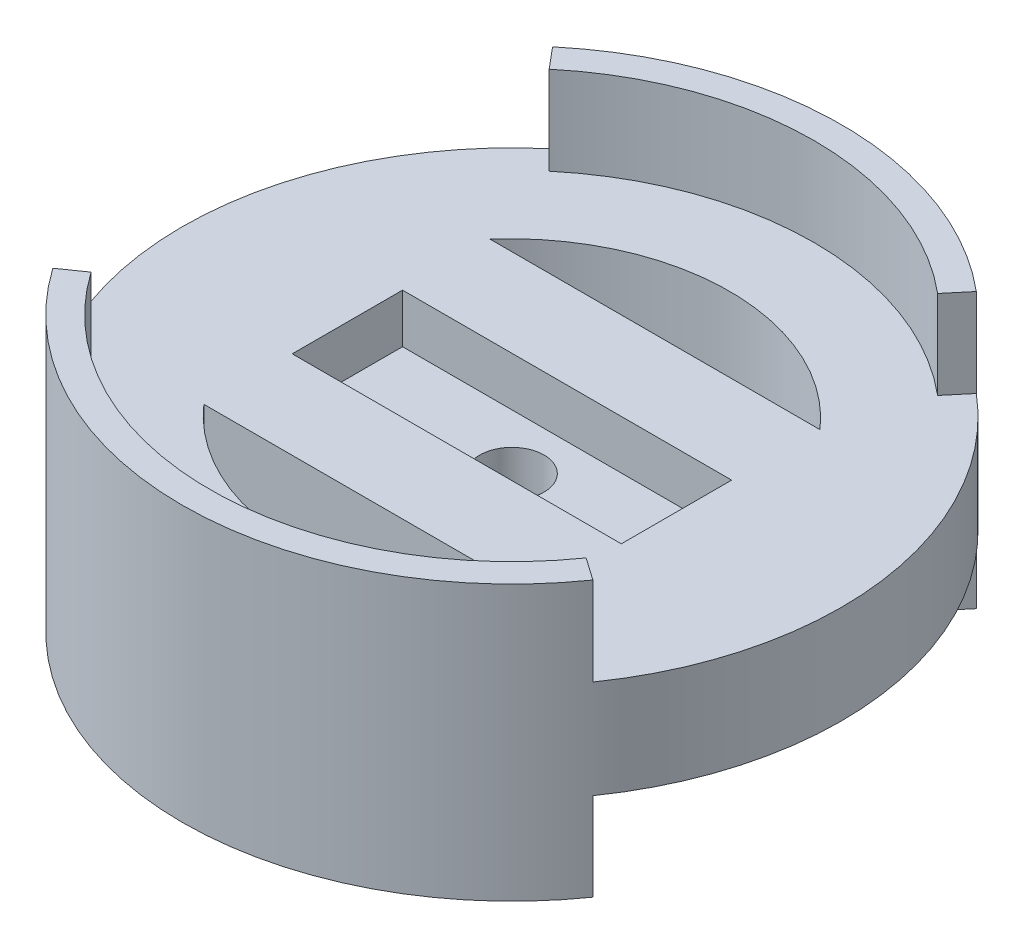
ISO-10303-21;
HEADER;
FILE_DESCRIPTION(('STEP AP214'),'2;1');
FILE_NAME('part.step','',(''),(''),'','','');
FILE_SCHEMA(('AUTOMOTIVE_DESIGN { 1 0 10303 214 1 1 1 1 }'));
ENDSEC;
DATA;
#1=APPLICATION_CONTEXT('core data for automotive mechanical design processes');
#2=APPLICATION_PROTOCOL_DEFINITION('international standard','automotive_design',2000,#1);
#3=PRODUCT_CONTEXT('',#1,'mechanical');
#4=PRODUCT('Part','Part','',(#3));
#5=PRODUCT_RELATED_PRODUCT_CATEGORY('part','',(#4));
#6=PRODUCT_DEFINITION_FORMATION('','',#4);
#7=PRODUCT_DEFINITION_CONTEXT('part definition',#1,'design');
#8=PRODUCT_DEFINITION('design','',#6,#7);
#9=PRODUCT_DEFINITION_SHAPE('','',#8);
#10=(LENGTH_UNIT() NAMED_UNIT(*) SI_UNIT(.MILLI.,.METRE.));
#11=(NAMED_UNIT(*) PLANE_ANGLE_UNIT() SI_UNIT($,.RADIAN.));
#12=(NAMED_UNIT(*) SI_UNIT($,.STERADIAN.) SOLID_ANGLE_UNIT());
#13=UNCERTAINTY_MEASURE_WITH_UNIT(LENGTH_MEASURE(1.E-05),#10,'distance_accuracy_value','');
#14=(GEOMETRIC_REPRESENTATION_CONTEXT(3) GLOBAL_UNCERTAINTY_ASSIGNED_CONTEXT((#13)) GLOBAL_UNIT_ASSIGNED_CONTEXT((#10,
#11,#12)) REPRESENTATION_CONTEXT('',''));
#15=CARTESIAN_POINT('',(0.,0.,0.));
#16=DIRECTION('',(0.,0.,1.));
#17=DIRECTION('',(1.,0.,0.));
#18=AXIS2_PLACEMENT_3D('',#15,#16,#17);
#19=CARTESIAN_POINT('',(0.,5.6642,0.));
#20=DIRECTION('',(0.,1.,0.));
#21=DIRECTION('',(0.,0.,1.));
#22=AXIS2_PLACEMENT_3D('',#19,#20,#21);
#23=PLANE('',#22);
#24=CARTESIAN_POINT('',(0.,5.6642,0.236275969920232));
#25=DIRECTION('',(0.,1.,0.));
#26=DIRECTION('',(0.,0.,-1.));
#27=AXIS2_PLACEMENT_3D('',#24,#25,#26);
#28=CIRCLE('',#27,25.4);
#29=CARTESIAN_POINT('',(19.0754,5.6642,-16.5354));
#30=VERTEX_POINT('',#29);
#31=CARTESIAN_POINT('',(-19.0754,5.6642,-16.5354));
#32=VERTEX_POINT('',#31);
#33=EDGE_CURVE('E55',#30,#32,#28,.T.);
#34=ORIENTED_EDGE('',*,*,#33,.F.);
#35=DIRECTION('',(1.,0.,0.));
#36=VECTOR('',#35,1.);
#37=CARTESIAN_POINT('',(-19.0754,5.6642,-16.5354));
#38=LINE('',#37,#36);
#39=EDGE_CURVE('E210',#32,#30,#38,.T.);
#40=ORIENTED_EDGE('',*,*,#39,.F.);
#41=EDGE_LOOP('',(#34,#40));
#42=FACE_BOUND('',#41,.T.);
#43=CARTESIAN_POINT('',(0.,5.6642,-0.236275969920232));
#44=DIRECTION('',(0.,1.,0.));
#45=DIRECTION('',(0.,0.,1.));
#46=AXIS2_PLACEMENT_3D('',#43,#44,#45);
#47=CIRCLE('',#46,25.4);
#48=CARTESIAN_POINT('',(-19.0754,5.6642,16.5354));
#49=VERTEX_POINT('',#48);
#50=CARTESIAN_POINT('',(19.0754,5.6642,16.5354));
#51=VERTEX_POINT('',#50);
#52=EDGE_CURVE('E63',#49,#51,#47,.T.);
#53=ORIENTED_EDGE('',*,*,#52,.F.);
#54=DIRECTION('',(-1.,0.,0.));
#55=VECTOR('',#54,1.);
#56=CARTESIAN_POINT('',(-19.0754,5.6642,16.5354));
#57=LINE('',#56,#55);
#58=EDGE_CURVE('E222',#51,#49,#57,.T.);
#59=ORIENTED_EDGE('',*,*,#58,.F.);
#60=EDGE_LOOP('',(#53,#59));
#61=FACE_BOUND('',#60,.T.);
#62=DIRECTION('',(-1.,0.,0.));
#63=VECTOR('',#62,1.);
#64=CARTESIAN_POINT('',(0.,5.6642,6.3754));
#65=LINE('',#64,#63);
#66=CARTESIAN_POINT('',(19.01825,5.6642,6.3754));
#67=VERTEX_POINT('',#66);
#68=CARTESIAN_POINT('',(-19.01825,5.6642,6.3754));
#69=VERTEX_POINT('',#68);
#70=EDGE_CURVE('E333',#67,#69,#65,.T.);
#71=ORIENTED_EDGE('',*,*,#70,.T.);
#72=DIRECTION('',(0.,0.,-1.));
#73=VECTOR('',#72,1.);
#74=CARTESIAN_POINT('',(-19.01825,5.6642,0.));
#75=LINE('',#74,#73);
#76=CARTESIAN_POINT('',(-19.01825,5.6642,-6.3754));
#77=VERTEX_POINT('',#76);
#78=EDGE_CURVE('E336',#69,#77,#75,.T.);
#79=ORIENTED_EDGE('',*,*,#78,.T.);
#80=DIRECTION('',(-1.,0.,0.));
#81=VECTOR('',#80,1.);
#82=CARTESIAN_POINT('',(0.,5.6642,-6.3754));
#83=LINE('',#82,#81);
#84=CARTESIAN_POINT('',(19.01825,5.6642,-6.3754));
#85=VERTEX_POINT('',#84);
#86=EDGE_CURVE('E339',#85,#77,#83,.T.);
#87=ORIENTED_EDGE('',*,*,#86,.F.);
#88=DIRECTION('',(0.,0.,-1.));
#89=VECTOR('',#88,1.);
#90=CARTESIAN_POINT('',(19.01825,5.6642,0.));
#91=LINE('',#90,#89);
#92=EDGE_CURVE('E342',#67,#85,#91,.T.);
#93=ORIENTED_EDGE('',*,*,#92,.F.);
#94=EDGE_LOOP('',(#71,#79,#87,#93));
#95=FACE_BOUND('',#94,.T.);
#96=CARTESIAN_POINT('',(0.,5.6642,0.));
#97=DIRECTION('',(0.,1.,0.));
#98=DIRECTION('',(0.,0.,1.));
#99=AXIS2_PLACEMENT_3D('',#96,#97,#98);
#100=CIRCLE('',#99,38.1);
#101=CARTESIAN_POINT('',(31.2096928874106,5.6642,21.8532622249748));
#102=VERTEX_POINT('',#101);
#103=CARTESIAN_POINT('',(24.4902079290572,5.6642,-29.1862932828331));
#104=VERTEX_POINT('',#103);
#105=EDGE_CURVE('E346',#102,#104,#100,.T.);
#106=ORIENTED_EDGE('',*,*,#105,.T.);
#107=DIRECTION('',(-0.64278760968654,0.,0.766044443118978));
#108=VECTOR('',#107,1.);
#109=CARTESIAN_POINT('',(0.,5.6642,0.));
#110=LINE('',#109,#108);
#111=CARTESIAN_POINT('',(22.4493572683024,5.6642,-26.7541021759303));
#112=VERTEX_POINT('',#111);
#113=EDGE_CURVE('E271',#104,#112,#110,.T.);
#114=ORIENTED_EDGE('',*,*,#113,.T.);
#115=CARTESIAN_POINT('',(0.,5.6642,0.));
#116=DIRECTION('',(0.,1.,0.));
#117=DIRECTION('',(0.,0.,1.));
#118=AXIS2_PLACEMENT_3D('',#115,#116,#117);
#119=CIRCLE('',#118,34.925);
#120=CARTESIAN_POINT('',(-22.4493572683024,5.6642,-26.7541021759303));
#121=VERTEX_POINT('',#120);
#122=EDGE_CURVE('E273',#121,#112,#119,.F.);
#123=ORIENTED_EDGE('',*,*,#122,.F.);
#124=DIRECTION('',(0.64278760968654,0.,0.766044443118977));
#125=VECTOR('',#124,1.);
#126=CARTESIAN_POINT('',(0.,5.6642,0.));
#127=LINE('',#126,#125);
#128=CARTESIAN_POINT('',(-24.4902079290572,5.6642,-29.186293282833));
#129=VERTEX_POINT('',#128);
#130=EDGE_CURVE('E266',#129,#121,#127,.T.);
#131=ORIENTED_EDGE('',*,*,#130,.F.);
#132=CARTESIAN_POINT('',(-31.2096928874107,5.6642,21.8532622249748));
#133=VERTEX_POINT('',#132);
#134=EDGE_CURVE('E345',#129,#133,#100,.T.);
#135=ORIENTED_EDGE('',*,*,#134,.T.);
#136=DIRECTION('',(0.819152044288994,0.,-0.573576436351043));
#137=VECTOR('',#136,1.);
#138=CARTESIAN_POINT('',(0.,5.6642,0.));
#139=LINE('',#138,#137);
#140=CARTESIAN_POINT('',(-28.6088851467931,5.6642,20.0321570395602));
#141=VERTEX_POINT('',#140);
#142=EDGE_CURVE('E317',#133,#141,#139,.T.);
#143=ORIENTED_EDGE('',*,*,#142,.T.);
#144=CARTESIAN_POINT('',(0.,5.6642,0.));
#145=DIRECTION('',(0.,1.,0.));
#146=DIRECTION('',(0.,0.,1.));
#147=AXIS2_PLACEMENT_3D('',#144,#145,#146);
#148=CIRCLE('',#147,34.925);
#149=CARTESIAN_POINT('',(28.6088851467931,5.6642,20.0321570395602));
#150=VERTEX_POINT('',#149);
#151=EDGE_CURVE('E319',#150,#141,#148,.F.);
#152=ORIENTED_EDGE('',*,*,#151,.F.);
#153=DIRECTION('',(-0.819152044288993,0.,-0.573576436351045));
#154=VECTOR('',#153,1.);
#155=CARTESIAN_POINT('',(0.,5.6642,0.));
#156=LINE('',#155,#154);
#157=EDGE_CURVE('E314',#102,#150,#156,.T.);
#158=ORIENTED_EDGE('',*,*,#157,.F.);
#159=EDGE_LOOP('',(#106,#114,#123,#131,#135,#143,#152,#158));
#160=FACE_BOUND('',#159,.T.);
#161=ADVANCED_FACE('F40',(#42,#61,#95,#160),#23,.T.);
#162=CARTESIAN_POINT('',(0.,-5.715,0.));
#163=DIRECTION('',(0.,1.,0.));
#164=DIRECTION('',(0.,0.,1.));
#165=AXIS2_PLACEMENT_3D('',#162,#163,#164);
#166=PLANE('',#165);
#167=DIRECTION('',(1.,0.,0.));
#168=VECTOR('',#167,1.);
#169=CARTESIAN_POINT('',(0.,-5.715,-16.5354));
#170=LINE('',#169,#168);
#171=CARTESIAN_POINT('',(-19.0754,-5.715,-16.5354));
#172=VERTEX_POINT('',#171);
#173=CARTESIAN_POINT('',(19.0754,-5.715,-16.5354));
#174=VERTEX_POINT('',#173);
#175=EDGE_CURVE('E48',#172,#174,#170,.T.);
#176=ORIENTED_EDGE('',*,*,#175,.T.);
#177=CARTESIAN_POINT('',(0.,-5.715,0.236275969920232));
#178=DIRECTION('',(0.,1.,0.));
#179=DIRECTION('',(0.,0.,1.));
#180=AXIS2_PLACEMENT_3D('',#177,#178,#179);
#181=CIRCLE('',#180,25.4);
#182=EDGE_CURVE('E11',#174,#172,#181,.T.);
#183=ORIENTED_EDGE('',*,*,#182,.T.);
#184=EDGE_LOOP('',(#176,#183));
#185=FACE_BOUND('',#184,.T.);
#186=DIRECTION('',(-1.,0.,0.));
#187=VECTOR('',#186,1.);
#188=CARTESIAN_POINT('',(0.,-5.715,16.5354));
#189=LINE('',#188,#187);
#190=CARTESIAN_POINT('',(19.0754,-5.715,16.5354));
#191=VERTEX_POINT('',#190);
#192=CARTESIAN_POINT('',(-19.0754,-5.715,16.5354));
#193=VERTEX_POINT('',#192);
#194=EDGE_CURVE('E379',#191,#193,#189,.T.);
#195=ORIENTED_EDGE('',*,*,#194,.T.);
#196=CARTESIAN_POINT('',(0.,-5.715,-0.236275969920232));
#197=DIRECTION('',(0.,1.,0.));
#198=DIRECTION('',(0.,0.,1.));
#199=AXIS2_PLACEMENT_3D('',#196,#197,#198);
#200=CIRCLE('',#199,25.4);
#201=EDGE_CURVE('E382',#193,#191,#200,.T.);
#202=ORIENTED_EDGE('',*,*,#201,.T.);
#203=EDGE_LOOP('',(#195,#202));
#204=FACE_BOUND('',#203,.T.);
#205=CARTESIAN_POINT('',(0.,-5.715,0.));
#206=DIRECTION('',(0.,1.,0.));
#207=DIRECTION('',(0.,0.,1.));
#208=AXIS2_PLACEMENT_3D('',#205,#206,#207);
#209=CIRCLE('',#208,3.71475);
#210=CARTESIAN_POINT('',(0.,-5.715,3.71475));
#211=VERTEX_POINT('',#210);
#212=EDGE_CURVE('E326',#211,#211,#209,.T.);
#213=ORIENTED_EDGE('',*,*,#212,.T.);
#214=EDGE_LOOP('',(#213));
#215=FACE_BOUND('',#214,.T.);
#216=DIRECTION('',(-0.64278760968654,0.,0.766044443118978));
#217=VECTOR('',#216,1.);
#218=CARTESIAN_POINT('',(0.,-5.715,0.));
#219=LINE('',#218,#217);
#220=CARTESIAN_POINT('',(24.4902079290572,-5.71499999999999,-29.186293282833));
#221=VERTEX_POINT('',#220);
#222=CARTESIAN_POINT('',(22.4493572683024,-5.715,-26.7541021759303));
#223=VERTEX_POINT('',#222);
#224=EDGE_CURVE('E269',#221,#223,#219,.T.);
#225=ORIENTED_EDGE('',*,*,#224,.F.);
#226=CARTESIAN_POINT('',(0.,-5.715,0.));
#227=DIRECTION('',(0.,1.,0.));
#228=DIRECTION('',(0.,0.,1.));
#229=AXIS2_PLACEMENT_3D('',#226,#227,#228);
#230=CIRCLE('',#229,38.1);
#231=CARTESIAN_POINT('',(31.2096928874107,-5.715,21.8532622249748));
#232=VERTEX_POINT('',#231);
#233=EDGE_CURVE('E323',#232,#221,#230,.T.);
#234=ORIENTED_EDGE('',*,*,#233,.F.);
#235=DIRECTION('',(-0.819152044288993,0.,-0.573576436351045));
#236=VECTOR('',#235,1.);
#237=CARTESIAN_POINT('',(0.,-5.715,0.));
#238=LINE('',#237,#236);
#239=CARTESIAN_POINT('',(28.6088851467931,-5.715,20.0321570395602));
#240=VERTEX_POINT('',#239);
#241=EDGE_CURVE('E368',#232,#240,#238,.T.);
#242=ORIENTED_EDGE('',*,*,#241,.T.);
#243=CARTESIAN_POINT('',(0.,-5.715,0.));
#244=DIRECTION('',(0.,1.,0.));
#245=DIRECTION('',(0.,0.,1.));
#246=AXIS2_PLACEMENT_3D('',#243,#244,#245);
#247=CIRCLE('',#246,34.925);
#248=CARTESIAN_POINT('',(-28.6088851467931,-5.715,20.0321570395602));
#249=VERTEX_POINT('',#248);
#250=EDGE_CURVE('E371',#240,#249,#247,.F.);
#251=ORIENTED_EDGE('',*,*,#250,.T.);
#252=DIRECTION('',(0.819152044288994,0.,-0.573576436351043));
#253=VECTOR('',#252,1.);
#254=CARTESIAN_POINT('',(0.,-5.715,0.));
#255=LINE('',#254,#253);
#256=CARTESIAN_POINT('',(-31.2096928874106,-5.715,21.8532622249747));
#257=VERTEX_POINT('',#256);
#258=EDGE_CURVE('E374',#257,#249,#255,.T.);
#259=ORIENTED_EDGE('',*,*,#258,.F.);
#260=CARTESIAN_POINT('',(-24.4902079290572,-5.71499999999999,-29.186293282833));
#261=VERTEX_POINT('',#260);
#262=EDGE_CURVE('E327',#261,#257,#230,.T.);
#263=ORIENTED_EDGE('',*,*,#262,.F.);
#264=DIRECTION('',(0.64278760968654,0.,0.766044443118977));
#265=VECTOR('',#264,1.);
#266=CARTESIAN_POINT('',(0.,-5.715,0.));
#267=LINE('',#266,#265);
#268=CARTESIAN_POINT('',(-22.4493572683024,-5.715,-26.7541021759303));
#269=VERTEX_POINT('',#268);
#270=EDGE_CURVE('E263',#261,#269,#267,.T.);
#271=ORIENTED_EDGE('',*,*,#270,.T.);
#272=CARTESIAN_POINT('',(0.,-5.715,0.));
#273=DIRECTION('',(0.,1.,0.));
#274=DIRECTION('',(0.,0.,1.));
#275=AXIS2_PLACEMENT_3D('',#272,#273,#274);
#276=CIRCLE('',#275,34.925);
#277=EDGE_CURVE('E376',#269,#223,#276,.F.);
#278=ORIENTED_EDGE('',*,*,#277,.T.);
#279=EDGE_LOOP('',(#225,#234,#242,#251,#259,#263,#271,#278));
#280=FACE_BOUND('',#279,.T.);
#281=ADVANCED_FACE('F385',(#185,#204,#215,#280),#166,.F.);
#282=CARTESIAN_POINT('',(0.,5.6642,6.3754));
#283=DIRECTION('',(0.,0.,1.));
#284=DIRECTION('',(1.,0.,0.));
#285=AXIS2_PLACEMENT_3D('',#282,#283,#284);
#286=PLANE('',#285);
#287=DIRECTION('',(-1.,0.,0.));
#288=VECTOR('',#287,1.);
#289=CARTESIAN_POINT('',(0.,0.,6.3754));
#290=LINE('',#289,#288);
#291=CARTESIAN_POINT('',(19.01825,0.,6.3754));
#292=VERTEX_POINT('',#291);
#293=CARTESIAN_POINT('',(-19.01825,0.,6.3754));
#294=VERTEX_POINT('',#293);
#295=EDGE_CURVE('E330',#292,#294,#290,.T.);
#296=ORIENTED_EDGE('',*,*,#295,.T.);
#297=DIRECTION('',(0.,-1.,0.));
#298=VECTOR('',#297,1.);
#299=CARTESIAN_POINT('',(-19.01825,5.6642,6.3754));
#300=LINE('',#299,#298);
#301=EDGE_CURVE('E365',#69,#294,#300,.T.);
#302=ORIENTED_EDGE('',*,*,#301,.F.);
#303=ORIENTED_EDGE('',*,*,#70,.F.);
#304=DIRECTION('',(0.,-1.,0.));
#305=VECTOR('',#304,1.);
#306=CARTESIAN_POINT('',(19.01825,5.6642,6.3754));
#307=LINE('',#306,#305);
#308=EDGE_CURVE('E348',#67,#292,#307,.T.);
#309=ORIENTED_EDGE('',*,*,#308,.T.);
#310=EDGE_LOOP('',(#296,#302,#303,#309));
#311=FACE_BOUND('',#310,.T.);
#312=ADVANCED_FACE('F42',(#311),#286,.F.);
#313=CARTESIAN_POINT('',(-19.01825,5.6642,0.));
#314=DIRECTION('',(-1.,0.,0.));
#315=DIRECTION('',(0.,0.,1.));
#316=AXIS2_PLACEMENT_3D('',#313,#314,#315);
#317=PLANE('',#316);
#318=DIRECTION('',(0.,0.,-1.));
#319=VECTOR('',#318,1.);
#320=CARTESIAN_POINT('',(-19.01825,0.,0.));
#321=LINE('',#320,#319);
#322=CARTESIAN_POINT('',(-19.01825,0.,-6.3754));
#323=VERTEX_POINT('',#322);
#324=EDGE_CURVE('E351',#294,#323,#321,.T.);
#325=ORIENTED_EDGE('',*,*,#324,.T.);
#326=DIRECTION('',(0.,-1.,0.));
#327=VECTOR('',#326,1.);
#328=CARTESIAN_POINT('',(-19.01825,5.6642,-6.3754));
#329=LINE('',#328,#327);
#330=EDGE_CURVE('E362',#77,#323,#329,.T.);
#331=ORIENTED_EDGE('',*,*,#330,.F.);
#332=ORIENTED_EDGE('',*,*,#78,.F.);
#333=ORIENTED_EDGE('',*,*,#301,.T.);
#334=EDGE_LOOP('',(#325,#331,#332,#333));
#335=FACE_BOUND('',#334,.T.);
#336=ADVANCED_FACE('F446',(#335),#317,.F.);
#337=CARTESIAN_POINT('',(0.,5.6642,-6.3754));
#338=DIRECTION('',(0.,0.,1.));
#339=DIRECTION('',(1.,0.,0.));
#340=AXIS2_PLACEMENT_3D('',#337,#338,#339);
#341=PLANE('',#340);
#342=DIRECTION('',(-1.,0.,0.));
#343=VECTOR('',#342,1.);
#344=CARTESIAN_POINT('',(0.,0.,-6.3754));
#345=LINE('',#344,#343);
#346=CARTESIAN_POINT('',(19.01825,0.,-6.3754));
#347=VERTEX_POINT('',#346);
#348=EDGE_CURVE('E354',#347,#323,#345,.T.);
#349=ORIENTED_EDGE('',*,*,#348,.F.);
#350=DIRECTION('',(0.,-1.,0.));
#351=VECTOR('',#350,1.);
#352=CARTESIAN_POINT('',(19.01825,5.6642,-6.3754));
#353=LINE('',#352,#351);
#354=EDGE_CURVE('E359',#85,#347,#353,.T.);
#355=ORIENTED_EDGE('',*,*,#354,.F.);
#356=ORIENTED_EDGE('',*,*,#86,.T.);
#357=ORIENTED_EDGE('',*,*,#330,.T.);
#358=EDGE_LOOP('',(#349,#355,#356,#357));
#359=FACE_BOUND('',#358,.T.);
#360=ADVANCED_FACE('F443',(#359),#341,.T.);
#361=CARTESIAN_POINT('',(19.01825,5.6642,0.));
#362=DIRECTION('',(-1.,0.,0.));
#363=DIRECTION('',(0.,0.,1.));
#364=AXIS2_PLACEMENT_3D('',#361,#362,#363);
#365=PLANE('',#364);
#366=DIRECTION('',(0.,0.,-1.));
#367=VECTOR('',#366,1.);
#368=CARTESIAN_POINT('',(19.01825,0.,0.));
#369=LINE('',#368,#367);
#370=EDGE_CURVE('E337',#292,#347,#369,.T.);
#371=ORIENTED_EDGE('',*,*,#370,.F.);
#372=ORIENTED_EDGE('',*,*,#308,.F.);
#373=ORIENTED_EDGE('',*,*,#92,.T.);
#374=ORIENTED_EDGE('',*,*,#354,.T.);
#375=EDGE_LOOP('',(#371,#372,#373,#374));
#376=FACE_BOUND('',#375,.T.);
#377=ADVANCED_FACE('F440',(#376),#365,.T.);
#378=CARTESIAN_POINT('',(0.,5.6642,0.));
#379=DIRECTION('',(0.,-1.,0.));
#380=DIRECTION('',(0.,0.,-1.));
#381=AXIS2_PLACEMENT_3D('',#378,#379,#380);
#382=CYLINDRICAL_SURFACE('',#381,38.1);
#383=ORIENTED_EDGE('',*,*,#233,.T.);
#384=DIRECTION('',(0.,-1.,0.));
#385=VECTOR('',#384,1.);
#386=CARTESIAN_POINT('',(24.4902079290572,15.875,-29.186293282833));
#387=LINE('',#386,#385);
#388=CARTESIAN_POINT('',(24.4902079290572,-15.875,-29.186293282833));
#389=VERTEX_POINT('',#388);
#390=EDGE_CURVE('E255',#221,#389,#387,.T.);
#391=ORIENTED_EDGE('',*,*,#390,.T.);
#392=CARTESIAN_POINT('',(0.,-15.875,0.));
#393=DIRECTION('',(0.,1.,0.));
#394=DIRECTION('',(0.,0.,1.));
#395=AXIS2_PLACEMENT_3D('',#392,#393,#394);
#396=CIRCLE('',#395,38.1);
#397=CARTESIAN_POINT('',(-24.4902079290572,-15.875,-29.186293282833));
#398=VERTEX_POINT('',#397);
#399=EDGE_CURVE('E243',#389,#398,#396,.T.);
#400=ORIENTED_EDGE('',*,*,#399,.T.);
#401=DIRECTION('',(0.,-1.,0.));
#402=VECTOR('',#401,1.);
#403=CARTESIAN_POINT('',(-24.4902079290572,15.875,-29.186293282833));
#404=LINE('',#403,#402);
#405=EDGE_CURVE('E251',#261,#398,#404,.T.);
#406=ORIENTED_EDGE('',*,*,#405,.F.);
#407=ORIENTED_EDGE('',*,*,#262,.T.);
#408=DIRECTION('',(0.,-1.,0.));
#409=VECTOR('',#408,1.);
#410=CARTESIAN_POINT('',(-31.2096928874106,15.875,21.8532622249747));
#411=LINE('',#410,#409);
#412=CARTESIAN_POINT('',(-31.2096928874106,-15.875,21.8532622249747));
#413=VERTEX_POINT('',#412);
#414=EDGE_CURVE('E306',#257,#413,#411,.T.);
#415=ORIENTED_EDGE('',*,*,#414,.T.);
#416=CARTESIAN_POINT('',(0.,-15.875,0.));
#417=DIRECTION('',(0.,1.,0.));
#418=DIRECTION('',(0.,0.,1.));
#419=AXIS2_PLACEMENT_3D('',#416,#417,#418);
#420=CIRCLE('',#419,38.1);
#421=CARTESIAN_POINT('',(31.2096928874107,-15.875,21.8532622249748));
#422=VERTEX_POINT('',#421);
#423=EDGE_CURVE('E294',#413,#422,#420,.T.);
#424=ORIENTED_EDGE('',*,*,#423,.T.);
#425=DIRECTION('',(0.,-1.,0.));
#426=VECTOR('',#425,1.);
#427=CARTESIAN_POINT('',(31.2096928874107,15.875,21.8532622249748));
#428=LINE('',#427,#426);
#429=EDGE_CURVE('E302',#232,#422,#428,.T.);
#430=ORIENTED_EDGE('',*,*,#429,.F.);
#431=EDGE_LOOP('',(#383,#391,#400,#406,#407,#415,#424,#430));
#432=FACE_BOUND('',#431,.T.);
#433=ORIENTED_EDGE('',*,*,#134,.F.);
#434=CARTESIAN_POINT('',(-24.4902079290572,15.875,-29.186293282833));
#435=VERTEX_POINT('',#434);
#436=EDGE_CURVE('E252',#435,#129,#404,.T.);
#437=ORIENTED_EDGE('',*,*,#436,.F.);
#438=CARTESIAN_POINT('',(0.,15.875,0.));
#439=DIRECTION('',(0.,1.,0.));
#440=DIRECTION('',(0.,0.,1.));
#441=AXIS2_PLACEMENT_3D('',#438,#439,#440);
#442=CIRCLE('',#441,38.1);
#443=CARTESIAN_POINT('',(24.4902079290572,15.875,-29.186293282833));
#444=VERTEX_POINT('',#443);
#445=EDGE_CURVE('E232',#444,#435,#442,.T.);
#446=ORIENTED_EDGE('',*,*,#445,.F.);
#447=EDGE_CURVE('E256',#444,#104,#387,.T.);
#448=ORIENTED_EDGE('',*,*,#447,.T.);
#449=ORIENTED_EDGE('',*,*,#105,.F.);
#450=CARTESIAN_POINT('',(31.2096928874107,15.875,21.8532622249748));
#451=VERTEX_POINT('',#450);
#452=EDGE_CURVE('E303',#451,#102,#428,.T.);
#453=ORIENTED_EDGE('',*,*,#452,.F.);
#454=CARTESIAN_POINT('',(0.,15.875,0.));
#455=DIRECTION('',(0.,1.,0.));
#456=DIRECTION('',(0.,0.,1.));
#457=AXIS2_PLACEMENT_3D('',#454,#455,#456);
#458=CIRCLE('',#457,38.1);
#459=CARTESIAN_POINT('',(-31.2096928874106,15.875,21.8532622249747));
#460=VERTEX_POINT('',#459);
#461=EDGE_CURVE('E283',#460,#451,#458,.T.);
#462=ORIENTED_EDGE('',*,*,#461,.F.);
#463=EDGE_CURVE('E307',#460,#133,#411,.T.);
#464=ORIENTED_EDGE('',*,*,#463,.T.);
#465=EDGE_LOOP('',(#433,#437,#446,#448,#449,#453,#462,#464));
#466=FACE_BOUND('',#465,.T.);
#467=ADVANCED_FACE('F399',(#432,#466),#382,.T.);
#468=CARTESIAN_POINT('',(0.,0.,0.));
#469=DIRECTION('',(0.,1.,0.));
#470=DIRECTION('',(0.,0.,1.));
#471=AXIS2_PLACEMENT_3D('',#468,#469,#470);
#472=PLANE('',#471);
#473=CARTESIAN_POINT('',(0.,0.,0.));
#474=DIRECTION('',(0.,1.,0.));
#475=DIRECTION('',(0.,0.,1.));
#476=AXIS2_PLACEMENT_3D('',#473,#474,#475);
#477=CIRCLE('',#476,3.71475);
#478=CARTESIAN_POINT('',(0.,0.,3.71475));
#479=VERTEX_POINT('',#478);
#480=EDGE_CURVE('E322',#479,#479,#477,.T.);
#481=ORIENTED_EDGE('',*,*,#480,.F.);
#482=EDGE_LOOP('',(#481));
#483=FACE_BOUND('',#482,.T.);
#484=ORIENTED_EDGE('',*,*,#295,.F.);
#485=ORIENTED_EDGE('',*,*,#370,.T.);
#486=ORIENTED_EDGE('',*,*,#348,.T.);
#487=ORIENTED_EDGE('',*,*,#324,.F.);
#488=EDGE_LOOP('',(#484,#485,#486,#487));
#489=FACE_BOUND('',#488,.T.);
#490=ADVANCED_FACE('F427',(#483,#489),#472,.T.);
#491=CARTESIAN_POINT('',(0.,-5.715,0.));
#492=DIRECTION('',(0.,1.,0.));
#493=DIRECTION('',(0.,0.,1.));
#494=AXIS2_PLACEMENT_3D('',#491,#492,#493);
#495=CYLINDRICAL_SURFACE('',#494,3.71475);
#496=ORIENTED_EDGE('',*,*,#212,.F.);
#497=EDGE_LOOP('',(#496));
#498=FACE_BOUND('',#497,.T.);
#499=ORIENTED_EDGE('',*,*,#480,.T.);
#500=EDGE_LOOP('',(#499));
#501=FACE_BOUND('',#500,.T.);
#502=ADVANCED_FACE('F419',(#498,#501),#495,.F.);
#503=CARTESIAN_POINT('',(0.,-15.875,0.));
#504=DIRECTION('',(0.,1.,0.));
#505=DIRECTION('',(0.,0.,1.));
#506=AXIS2_PLACEMENT_3D('',#503,#504,#505);
#507=PLANE('',#506);
#508=CARTESIAN_POINT('',(0.,-15.875,0.));
#509=DIRECTION('',(0.,1.,0.));
#510=DIRECTION('',(0.,0.,1.));
#511=AXIS2_PLACEMENT_3D('',#508,#509,#510);
#512=CIRCLE('',#511,34.925);
#513=CARTESIAN_POINT('',(-28.6088851467931,-15.875,20.0321570395602));
#514=VERTEX_POINT('',#513);
#515=CARTESIAN_POINT('',(28.6088851467931,-15.875,20.0321570395602));
#516=VERTEX_POINT('',#515);
#517=EDGE_CURVE('E276',#514,#516,#512,.T.);
#518=ORIENTED_EDGE('',*,*,#517,.T.);
#519=DIRECTION('',(0.819152044288993,0.,0.573576436351045));
#520=VECTOR('',#519,1.);
#521=CARTESIAN_POINT('',(0.,-15.875,0.));
#522=LINE('',#521,#520);
#523=EDGE_CURVE('E281',#516,#422,#522,.T.);
#524=ORIENTED_EDGE('',*,*,#523,.T.);
#525=ORIENTED_EDGE('',*,*,#423,.F.);
#526=DIRECTION('',(-0.819152044288994,0.,0.573576436351043));
#527=VECTOR('',#526,1.);
#528=CARTESIAN_POINT('',(0.,-15.875,0.));
#529=LINE('',#528,#527);
#530=EDGE_CURVE('E291',#514,#413,#529,.T.);
#531=ORIENTED_EDGE('',*,*,#530,.F.);
#532=EDGE_LOOP('',(#518,#524,#525,#531));
#533=FACE_BOUND('',#532,.T.);
#534=ADVANCED_FACE('F417',(#533),#507,.F.);
#535=CARTESIAN_POINT('',(0.,15.875,0.));
#536=DIRECTION('',(0.573576436351045,0.,-0.819152044288993));
#537=DIRECTION('',(-0.819152044288993,0.,-0.573576436351045));
#538=AXIS2_PLACEMENT_3D('',#535,#536,#537);
#539=PLANE('',#538);
#540=ORIENTED_EDGE('',*,*,#241,.F.);
#541=ORIENTED_EDGE('',*,*,#429,.T.);
#542=ORIENTED_EDGE('',*,*,#523,.F.);
#543=DIRECTION('',(0.,-1.,0.));
#544=VECTOR('',#543,1.);
#545=CARTESIAN_POINT('',(28.6088851467931,15.875,20.0321570395602));
#546=LINE('',#545,#544);
#547=EDGE_CURVE('E288',#240,#516,#546,.T.);
#548=ORIENTED_EDGE('',*,*,#547,.F.);
#549=EDGE_LOOP('',(#540,#541,#542,#548));
#550=FACE_BOUND('',#549,.T.);
#551=ADVANCED_FACE('F404',(#550),#539,.T.);
#552=CARTESIAN_POINT('',(0.,15.875,0.));
#553=DIRECTION('',(0.573576436351043,0.,0.819152044288994));
#554=DIRECTION('',(0.819152044288994,0.,-0.573576436351043));
#555=AXIS2_PLACEMENT_3D('',#552,#553,#554);
#556=PLANE('',#555);
#557=ORIENTED_EDGE('',*,*,#414,.F.);
#558=ORIENTED_EDGE('',*,*,#258,.T.);
#559=DIRECTION('',(0.,-1.,0.));
#560=VECTOR('',#559,1.);
#561=CARTESIAN_POINT('',(-28.6088851467931,15.875,20.0321570395602));
#562=LINE('',#561,#560);
#563=EDGE_CURVE('E310',#249,#514,#562,.T.);
#564=ORIENTED_EDGE('',*,*,#563,.T.);
#565=ORIENTED_EDGE('',*,*,#530,.T.);
#566=EDGE_LOOP('',(#557,#558,#564,#565));
#567=FACE_BOUND('',#566,.T.);
#568=ADVANCED_FACE('F415',(#567),#556,.F.);
#569=CARTESIAN_POINT('',(0.,15.875,0.));
#570=DIRECTION('',(0.,-1.,0.));
#571=DIRECTION('',(0.,0.,-1.));
#572=AXIS2_PLACEMENT_3D('',#569,#570,#571);
#573=CYLINDRICAL_SURFACE('',#572,34.925);
#574=ORIENTED_EDGE('',*,*,#250,.F.);
#575=ORIENTED_EDGE('',*,*,#547,.T.);
#576=ORIENTED_EDGE('',*,*,#517,.F.);
#577=ORIENTED_EDGE('',*,*,#563,.F.);
#578=EDGE_LOOP('',(#574,#575,#576,#577));
#579=FACE_BOUND('',#578,.T.);
#580=ADVANCED_FACE('F410',(#579),#573,.F.);
#581=CARTESIAN_POINT('',(28.6088851467931,15.875,20.0321570395602));
#582=VERTEX_POINT('',#581);
#583=EDGE_CURVE('E299',#582,#150,#546,.T.);
#584=ORIENTED_EDGE('',*,*,#583,.T.);
#585=ORIENTED_EDGE('',*,*,#151,.T.);
#586=CARTESIAN_POINT('',(-28.6088851467931,15.875,20.0321570395602));
#587=VERTEX_POINT('',#586);
#588=EDGE_CURVE('E311',#587,#141,#562,.T.);
#589=ORIENTED_EDGE('',*,*,#588,.F.);
#590=CARTESIAN_POINT('',(0.,15.875,0.));
#591=DIRECTION('',(0.,1.,0.));
#592=DIRECTION('',(0.,0.,1.));
#593=AXIS2_PLACEMENT_3D('',#590,#591,#592);
#594=CIRCLE('',#593,34.925);
#595=EDGE_CURVE('E277',#587,#582,#594,.T.);
#596=ORIENTED_EDGE('',*,*,#595,.T.);
#597=EDGE_LOOP('',(#584,#585,#589,#596));
#598=FACE_BOUND('',#597,.T.);
#599=ADVANCED_FACE('F527',(#598),#573,.F.);
#600=ORIENTED_EDGE('',*,*,#142,.F.);
#601=ORIENTED_EDGE('',*,*,#463,.F.);
#602=DIRECTION('',(-0.819152044288994,0.,0.573576436351043));
#603=VECTOR('',#602,1.);
#604=CARTESIAN_POINT('',(0.,15.875,0.));
#605=LINE('',#604,#603);
#606=EDGE_CURVE('E280',#587,#460,#605,.T.);
#607=ORIENTED_EDGE('',*,*,#606,.F.);
#608=ORIENTED_EDGE('',*,*,#588,.T.);
#609=EDGE_LOOP('',(#600,#601,#607,#608));
#610=FACE_BOUND('',#609,.T.);
#611=ADVANCED_FACE('F520',(#610),#556,.F.);
#612=ORIENTED_EDGE('',*,*,#452,.T.);
#613=ORIENTED_EDGE('',*,*,#157,.T.);
#614=ORIENTED_EDGE('',*,*,#583,.F.);
#615=DIRECTION('',(0.819152044288993,0.,0.573576436351045));
#616=VECTOR('',#615,1.);
#617=CARTESIAN_POINT('',(0.,15.875,0.));
#618=LINE('',#617,#616);
#619=EDGE_CURVE('E285',#582,#451,#618,.T.);
#620=ORIENTED_EDGE('',*,*,#619,.T.);
#621=EDGE_LOOP('',(#612,#613,#614,#620));
#622=FACE_BOUND('',#621,.T.);
#623=ADVANCED_FACE('F426',(#622),#539,.T.);
#624=CARTESIAN_POINT('',(0.,15.875,0.));
#625=DIRECTION('',(0.,1.,0.));
#626=DIRECTION('',(0.,0.,1.));
#627=AXIS2_PLACEMENT_3D('',#624,#625,#626);
#628=PLANE('',#627);
#629=ORIENTED_EDGE('',*,*,#595,.F.);
#630=ORIENTED_EDGE('',*,*,#606,.T.);
#631=ORIENTED_EDGE('',*,*,#461,.T.);
#632=ORIENTED_EDGE('',*,*,#619,.F.);
#633=EDGE_LOOP('',(#629,#630,#631,#632));
#634=FACE_BOUND('',#633,.T.);
#635=ADVANCED_FACE('F502',(#634),#628,.T.);
#636=CARTESIAN_POINT('',(0.,-15.875,0.));
#637=DIRECTION('',(0.,1.,0.));
#638=DIRECTION('',(0.,0.,1.));
#639=AXIS2_PLACEMENT_3D('',#636,#637,#638);
#640=PLANE('',#639);
#641=CARTESIAN_POINT('',(0.,-15.875,0.));
#642=DIRECTION('',(0.,1.,0.));
#643=DIRECTION('',(0.,0.,1.));
#644=AXIS2_PLACEMENT_3D('',#641,#642,#643);
#645=CIRCLE('',#644,34.925);
#646=CARTESIAN_POINT('',(22.4493572683024,-15.875,-26.7541021759303));
#647=VERTEX_POINT('',#646);
#648=CARTESIAN_POINT('',(-22.4493572683024,-15.875,-26.7541021759303));
#649=VERTEX_POINT('',#648);
#650=EDGE_CURVE('E206',#647,#649,#645,.T.);
#651=ORIENTED_EDGE('',*,*,#650,.T.);
#652=DIRECTION('',(-0.64278760968654,0.,-0.766044443118977));
#653=VECTOR('',#652,1.);
#654=CARTESIAN_POINT('',(0.,-15.875,0.));
#655=LINE('',#654,#653);
#656=EDGE_CURVE('E230',#649,#398,#655,.T.);
#657=ORIENTED_EDGE('',*,*,#656,.T.);
#658=ORIENTED_EDGE('',*,*,#399,.F.);
#659=DIRECTION('',(0.64278760968654,0.,-0.766044443118978));
#660=VECTOR('',#659,1.);
#661=CARTESIAN_POINT('',(0.,-15.875,0.));
#662=LINE('',#661,#660);
#663=EDGE_CURVE('E240',#647,#389,#662,.T.);
#664=ORIENTED_EDGE('',*,*,#663,.F.);
#665=EDGE_LOOP('',(#651,#657,#658,#664));
#666=FACE_BOUND('',#665,.T.);
#667=ADVANCED_FACE('F495',(#666),#640,.F.);
#668=CARTESIAN_POINT('',(0.,15.875,0.));
#669=DIRECTION('',(-0.766044443118977,0.,0.64278760968654));
#670=DIRECTION('',(0.64278760968654,0.,0.766044443118977));
#671=AXIS2_PLACEMENT_3D('',#668,#669,#670);
#672=PLANE('',#671);
#673=ORIENTED_EDGE('',*,*,#270,.F.);
#674=ORIENTED_EDGE('',*,*,#405,.T.);
#675=ORIENTED_EDGE('',*,*,#656,.F.);
#676=DIRECTION('',(0.,-1.,0.));
#677=VECTOR('',#676,1.);
#678=CARTESIAN_POINT('',(-22.4493572683024,15.875,-26.7541021759303));
#679=LINE('',#678,#677);
#680=EDGE_CURVE('E237',#269,#649,#679,.T.);
#681=ORIENTED_EDGE('',*,*,#680,.F.);
#682=EDGE_LOOP('',(#673,#674,#675,#681));
#683=FACE_BOUND('',#682,.T.);
#684=ADVANCED_FACE('F484',(#683),#672,.T.);
#685=CARTESIAN_POINT('',(0.,15.875,0.));
#686=DIRECTION('',(-0.766044443118978,0.,-0.64278760968654));
#687=DIRECTION('',(-0.64278760968654,0.,0.766044443118978));
#688=AXIS2_PLACEMENT_3D('',#685,#686,#687);
#689=PLANE('',#688);
#690=ORIENTED_EDGE('',*,*,#390,.F.);
#691=ORIENTED_EDGE('',*,*,#224,.T.);
#692=DIRECTION('',(0.,-1.,0.));
#693=VECTOR('',#692,1.);
#694=CARTESIAN_POINT('',(22.4493572683024,15.875,-26.7541021759303));
#695=LINE('',#694,#693);
#696=EDGE_CURVE('E259',#223,#647,#695,.T.);
#697=ORIENTED_EDGE('',*,*,#696,.T.);
#698=ORIENTED_EDGE('',*,*,#663,.T.);
#699=EDGE_LOOP('',(#690,#691,#697,#698));
#700=FACE_BOUND('',#699,.T.);
#701=ADVANCED_FACE('F492',(#700),#689,.F.);
#702=CARTESIAN_POINT('',(0.,15.875,0.));
#703=DIRECTION('',(0.,-1.,0.));
#704=DIRECTION('',(0.,0.,-1.));
#705=AXIS2_PLACEMENT_3D('',#702,#703,#704);
#706=CYLINDRICAL_SURFACE('',#705,34.925);
#707=ORIENTED_EDGE('',*,*,#277,.F.);
#708=ORIENTED_EDGE('',*,*,#680,.T.);
#709=ORIENTED_EDGE('',*,*,#650,.F.);
#710=ORIENTED_EDGE('',*,*,#696,.F.);
#711=EDGE_LOOP('',(#707,#708,#709,#710));
#712=FACE_BOUND('',#711,.T.);
#713=ADVANCED_FACE('F501',(#712),#706,.F.);
#714=CARTESIAN_POINT('',(-22.4493572683024,15.875,-26.7541021759303));
#715=VERTEX_POINT('',#714);
#716=EDGE_CURVE('E248',#715,#121,#679,.T.);
#717=ORIENTED_EDGE('',*,*,#716,.T.);
#718=ORIENTED_EDGE('',*,*,#122,.T.);
#719=CARTESIAN_POINT('',(22.4493572683024,15.875,-26.7541021759303));
#720=VERTEX_POINT('',#719);
#721=EDGE_CURVE('E260',#720,#112,#695,.T.);
#722=ORIENTED_EDGE('',*,*,#721,.F.);
#723=CARTESIAN_POINT('',(0.,15.875,0.));
#724=DIRECTION('',(0.,1.,0.));
#725=DIRECTION('',(0.,0.,1.));
#726=AXIS2_PLACEMENT_3D('',#723,#724,#725);
#727=CIRCLE('',#726,34.925);
#728=EDGE_CURVE('E226',#720,#715,#727,.T.);
#729=ORIENTED_EDGE('',*,*,#728,.T.);
#730=EDGE_LOOP('',(#717,#718,#722,#729));
#731=FACE_BOUND('',#730,.T.);
#732=ADVANCED_FACE('F479',(#731),#706,.F.);
#733=ORIENTED_EDGE('',*,*,#113,.F.);
#734=ORIENTED_EDGE('',*,*,#447,.F.);
#735=DIRECTION('',(0.64278760968654,0.,-0.766044443118978));
#736=VECTOR('',#735,1.);
#737=CARTESIAN_POINT('',(0.,15.875,0.));
#738=LINE('',#737,#736);
#739=EDGE_CURVE('E229',#720,#444,#738,.T.);
#740=ORIENTED_EDGE('',*,*,#739,.F.);
#741=ORIENTED_EDGE('',*,*,#721,.T.);
#742=EDGE_LOOP('',(#733,#734,#740,#741));
#743=FACE_BOUND('',#742,.T.);
#744=ADVANCED_FACE('F469',(#743),#689,.F.);
#745=ORIENTED_EDGE('',*,*,#436,.T.);
#746=ORIENTED_EDGE('',*,*,#130,.T.);
#747=ORIENTED_EDGE('',*,*,#716,.F.);
#748=DIRECTION('',(-0.64278760968654,0.,-0.766044443118977));
#749=VECTOR('',#748,1.);
#750=CARTESIAN_POINT('',(0.,15.875,0.));
#751=LINE('',#750,#749);
#752=EDGE_CURVE('E234',#715,#435,#751,.T.);
#753=ORIENTED_EDGE('',*,*,#752,.T.);
#754=EDGE_LOOP('',(#745,#746,#747,#753));
#755=FACE_BOUND('',#754,.T.);
#756=ADVANCED_FACE('F481',(#755),#672,.T.);
#757=CARTESIAN_POINT('',(0.,15.875,0.));
#758=DIRECTION('',(0.,1.,0.));
#759=DIRECTION('',(0.,0.,1.));
#760=AXIS2_PLACEMENT_3D('',#757,#758,#759);
#761=PLANE('',#760);
#762=ORIENTED_EDGE('',*,*,#728,.F.);
#763=ORIENTED_EDGE('',*,*,#739,.T.);
#764=ORIENTED_EDGE('',*,*,#445,.T.);
#765=ORIENTED_EDGE('',*,*,#752,.F.);
#766=EDGE_LOOP('',(#762,#763,#764,#765));
#767=FACE_BOUND('',#766,.T.);
#768=ADVANCED_FACE('F477',(#767),#761,.T.);
#769=CARTESIAN_POINT('',(0.,-15.875,-0.236275969920232));
#770=DIRECTION('',(0.,1.,0.));
#771=DIRECTION('',(0.,0.,1.));
#772=AXIS2_PLACEMENT_3D('',#769,#770,#771);
#773=CYLINDRICAL_SURFACE('',#772,25.4);
#774=DIRECTION('',(0.,1.,0.));
#775=VECTOR('',#774,1.);
#776=CARTESIAN_POINT('',(-19.0754,-15.875,16.5354));
#777=LINE('',#776,#775);
#778=EDGE_CURVE('E215',#193,#49,#777,.T.);
#779=ORIENTED_EDGE('',*,*,#778,.T.);
#780=ORIENTED_EDGE('',*,*,#52,.T.);
#781=DIRECTION('',(0.,1.,0.));
#782=VECTOR('',#781,1.);
#783=CARTESIAN_POINT('',(19.0754,-15.875,16.5354));
#784=LINE('',#783,#782);
#785=EDGE_CURVE('E217',#191,#51,#784,.T.);
#786=ORIENTED_EDGE('',*,*,#785,.F.);
#787=ORIENTED_EDGE('',*,*,#201,.F.);
#788=EDGE_LOOP('',(#779,#780,#786,#787));
#789=FACE_BOUND('',#788,.T.);
#790=ADVANCED_FACE('F489',(#789),#773,.F.);
#791=CARTESIAN_POINT('',(-19.0754,-15.875,16.5354));
#792=DIRECTION('',(0.,0.,-1.));
#793=DIRECTION('',(-1.,0.,0.));
#794=AXIS2_PLACEMENT_3D('',#791,#792,#793);
#795=PLANE('',#794);
#796=ORIENTED_EDGE('',*,*,#785,.T.);
#797=ORIENTED_EDGE('',*,*,#58,.T.);
#798=ORIENTED_EDGE('',*,*,#778,.F.);
#799=ORIENTED_EDGE('',*,*,#194,.F.);
#800=EDGE_LOOP('',(#796,#797,#798,#799));
#801=FACE_BOUND('',#800,.T.);
#802=ADVANCED_FACE('F654',(#801),#795,.F.);
#803=CARTESIAN_POINT('',(0.,-15.875,0.236275969920232));
#804=DIRECTION('',(0.,1.,0.));
#805=DIRECTION('',(0.,0.,1.));
#806=AXIS2_PLACEMENT_3D('',#803,#804,#805);
#807=CYLINDRICAL_SURFACE('',#806,25.4);
#808=DIRECTION('',(0.,1.,0.));
#809=VECTOR('',#808,1.);
#810=CARTESIAN_POINT('',(19.0754,-15.875,-16.5354));
#811=LINE('',#810,#809);
#812=EDGE_CURVE('E201',#174,#30,#811,.T.);
#813=ORIENTED_EDGE('',*,*,#812,.T.);
#814=ORIENTED_EDGE('',*,*,#33,.T.);
#815=DIRECTION('',(0.,1.,0.));
#816=VECTOR('',#815,1.);
#817=CARTESIAN_POINT('',(-19.0754,-15.875,-16.5354));
#818=LINE('',#817,#816);
#819=EDGE_CURVE('E207',#172,#32,#818,.T.);
#820=ORIENTED_EDGE('',*,*,#819,.F.);
#821=ORIENTED_EDGE('',*,*,#182,.F.);
#822=EDGE_LOOP('',(#813,#814,#820,#821));
#823=FACE_BOUND('',#822,.T.);
#824=ADVANCED_FACE('F203',(#823),#807,.F.);
#825=CARTESIAN_POINT('',(-19.0754,-15.875,-16.5354));
#826=DIRECTION('',(0.,0.,1.));
#827=DIRECTION('',(1.,0.,0.));
#828=AXIS2_PLACEMENT_3D('',#825,#826,#827);
#829=PLANE('',#828);
#830=ORIENTED_EDGE('',*,*,#819,.T.);
#831=ORIENTED_EDGE('',*,*,#39,.T.);
#832=ORIENTED_EDGE('',*,*,#812,.F.);
#833=ORIENTED_EDGE('',*,*,#175,.F.);
#834=EDGE_LOOP('',(#830,#831,#832,#833));
#835=FACE_BOUND('',#834,.T.);
#836=ADVANCED_FACE('F211',(#835),#829,.F.);
#837=CLOSED_SHELL('',(#161,#281,#312,#336,#360,#377,#467,#490,#502,#534,#551,#568,#580,#599,
#611,#623,#635,#667,#684,#701,#713,#732,#744,#756,#768,#790,#802,#824,#836));
#838=MANIFOLD_SOLID_BREP('B2',#837);
#839=ADVANCED_BREP_SHAPE_REPRESENTATION('',(#18,#838),#14);
#840=SHAPE_DEFINITION_REPRESENTATION(#9,#839);
ENDSEC;
END-ISO-10303-21;
